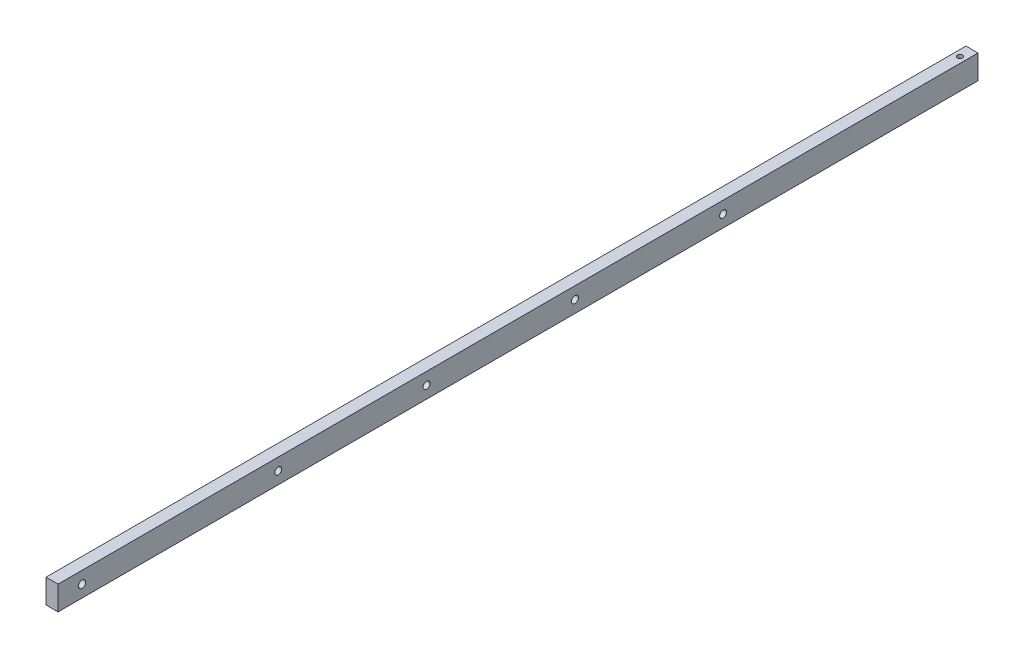
ISO-10303-21;
HEADER;
FILE_DESCRIPTION(('STEP AP214'),'2;1');
FILE_NAME('part.step','',(''),(''),'','','');
FILE_SCHEMA(('AUTOMOTIVE_DESIGN { 1 0 10303 214 1 1 1 1 }'));
ENDSEC;
DATA;
#1=APPLICATION_CONTEXT('core data for automotive mechanical design processes');
#2=APPLICATION_PROTOCOL_DEFINITION('international standard','automotive_design',2000,#1);
#3=PRODUCT_CONTEXT('',#1,'mechanical');
#4=PRODUCT('Part','Part','',(#3));
#5=PRODUCT_RELATED_PRODUCT_CATEGORY('part','',(#4));
#6=PRODUCT_DEFINITION_FORMATION('','',#4);
#7=PRODUCT_DEFINITION_CONTEXT('part definition',#1,'design');
#8=PRODUCT_DEFINITION('design','',#6,#7);
#9=PRODUCT_DEFINITION_SHAPE('','',#8);
#10=(LENGTH_UNIT() NAMED_UNIT(*) SI_UNIT(.MILLI.,.METRE.));
#11=(NAMED_UNIT(*) PLANE_ANGLE_UNIT() SI_UNIT($,.RADIAN.));
#12=(NAMED_UNIT(*) SI_UNIT($,.STERADIAN.) SOLID_ANGLE_UNIT());
#13=UNCERTAINTY_MEASURE_WITH_UNIT(LENGTH_MEASURE(1.E-05),#10,'distance_accuracy_value','');
#14=(GEOMETRIC_REPRESENTATION_CONTEXT(3) GLOBAL_UNCERTAINTY_ASSIGNED_CONTEXT((#13)) GLOBAL_UNIT_ASSIGNED_CONTEXT((#10,
#11,#12)) REPRESENTATION_CONTEXT('',''));
#15=CARTESIAN_POINT('',(0.,0.,0.));
#16=DIRECTION('',(0.,0.,1.));
#17=DIRECTION('',(1.,0.,0.));
#18=AXIS2_PLACEMENT_3D('',#15,#16,#17);
#19=CARTESIAN_POINT('',(0.,0.,485.14));
#20=DIRECTION('',(1.,0.,0.));
#21=DIRECTION('',(0.,0.,-1.));
#22=AXIS2_PLACEMENT_3D('',#19,#20,#21);
#23=PLANE('',#22);
#24=CARTESIAN_POINT('',(-1.10963978658706E-13,6.35000000000008,369.033439454375));
#25=DIRECTION('',(-1.,0.,0.));
#26=DIRECTION('',(0.,0.,1.));
#27=AXIS2_PLACEMENT_3D('',#24,#25,#26);
#28=CIRCLE('',#27,1.8288);
#29=CARTESIAN_POINT('',(-1.10963978658706E-13,6.35000000000008,370.862239454375));
#30=VERTEX_POINT('',#29);
#31=EDGE_CURVE('E155',#30,#30,#28,.T.);
#32=ORIENTED_EDGE('',*,*,#31,.F.);
#33=EDGE_LOOP('',(#32));
#34=FACE_BOUND('',#33,.T.);
#35=CARTESIAN_POINT('',(-1.10963978658706E-13,6.35000000000008,212.569439454375));
#36=DIRECTION('',(-1.,0.,0.));
#37=DIRECTION('',(0.,0.,1.));
#38=AXIS2_PLACEMENT_3D('',#35,#36,#37);
#39=CIRCLE('',#38,1.8288);
#40=CARTESIAN_POINT('',(-1.10963978658706E-13,6.35000000000008,214.398239454375));
#41=VERTEX_POINT('',#40);
#42=EDGE_CURVE('E149',#41,#41,#39,.T.);
#43=ORIENTED_EDGE('',*,*,#42,.F.);
#44=EDGE_LOOP('',(#43));
#45=FACE_BOUND('',#44,.T.);
#46=CARTESIAN_POINT('',(-1.10963978658706E-13,6.35000000000008,290.801439454375));
#47=DIRECTION('',(-1.,0.,0.));
#48=DIRECTION('',(0.,0.,1.));
#49=AXIS2_PLACEMENT_3D('',#46,#47,#48);
#50=CIRCLE('',#49,1.8288);
#51=CARTESIAN_POINT('',(-1.10963978658706E-13,6.35000000000008,292.630239454375));
#52=VERTEX_POINT('',#51);
#53=EDGE_CURVE('E143',#52,#52,#50,.T.);
#54=ORIENTED_EDGE('',*,*,#53,.F.);
#55=EDGE_LOOP('',(#54));
#56=FACE_BOUND('',#55,.T.);
#57=CARTESIAN_POINT('',(-1.10963978658706E-13,6.35000000000008,134.430638313341));
#58=DIRECTION('',(-1.,0.,0.));
#59=DIRECTION('',(0.,0.,1.));
#60=AXIS2_PLACEMENT_3D('',#57,#58,#59);
#61=CIRCLE('',#60,1.8288);
#62=CARTESIAN_POINT('',(-1.10963978658706E-13,6.35000000000008,136.259438313341));
#63=VERTEX_POINT('',#62);
#64=EDGE_CURVE('E137',#63,#63,#61,.T.);
#65=ORIENTED_EDGE('',*,*,#64,.F.);
#66=EDGE_LOOP('',(#65));
#67=FACE_BOUND('',#66,.T.);
#68=CARTESIAN_POINT('',(0.,6.35,472.44));
#69=DIRECTION('',(1.,0.,0.));
#70=DIRECTION('',(0.,0.,-1.));
#71=AXIS2_PLACEMENT_3D('',#68,#69,#70);
#72=CIRCLE('',#71,1.89865);
#73=CARTESIAN_POINT('',(0.,6.35,470.54135));
#74=VERTEX_POINT('',#73);
#75=EDGE_CURVE('E112',#74,#74,#72,.T.);
#76=ORIENTED_EDGE('',*,*,#75,.T.);
#77=EDGE_LOOP('',(#76));
#78=FACE_BOUND('',#77,.T.);
#79=DIRECTION('',(0.,-1.,0.));
#80=VECTOR('',#79,1.);
#81=CARTESIAN_POINT('',(0.,0.,0.));
#82=LINE('',#81,#80);
#83=CARTESIAN_POINT('',(0.,12.7,0.));
#84=VERTEX_POINT('',#83);
#85=CARTESIAN_POINT('',(0.,0.,0.));
#86=VERTEX_POINT('',#85);
#87=EDGE_CURVE('E109',#84,#86,#82,.T.);
#88=ORIENTED_EDGE('',*,*,#87,.T.);
#89=DIRECTION('',(0.,0.,-1.));
#90=VECTOR('',#89,1.);
#91=CARTESIAN_POINT('',(0.,0.,485.14));
#92=LINE('',#91,#90);
#93=CARTESIAN_POINT('',(0.,0.,485.14));
#94=VERTEX_POINT('',#93);
#95=EDGE_CURVE('E13',#94,#86,#92,.T.);
#96=ORIENTED_EDGE('',*,*,#95,.F.);
#97=DIRECTION('',(0.,-1.,0.));
#98=VECTOR('',#97,1.);
#99=CARTESIAN_POINT('',(0.,0.,485.14));
#100=LINE('',#99,#98);
#101=CARTESIAN_POINT('',(0.,12.7,485.14));
#102=VERTEX_POINT('',#101);
#103=EDGE_CURVE('E97',#102,#94,#100,.T.);
#104=ORIENTED_EDGE('',*,*,#103,.F.);
#105=DIRECTION('',(0.,0.,-1.));
#106=VECTOR('',#105,1.);
#107=CARTESIAN_POINT('',(0.,12.7,485.14));
#108=LINE('',#107,#106);
#109=EDGE_CURVE('E105',#102,#84,#108,.T.);
#110=ORIENTED_EDGE('',*,*,#109,.T.);
#111=EDGE_LOOP('',(#88,#96,#104,#110));
#112=FACE_BOUND('',#111,.T.);
#113=ADVANCED_FACE('F46',(#34,#45,#56,#67,#78,#112),#23,.F.);
#114=CARTESIAN_POINT('',(0.,0.,485.14));
#115=DIRECTION('',(0.,1.,0.));
#116=DIRECTION('',(0.,0.,1.));
#117=AXIS2_PLACEMENT_3D('',#114,#115,#116);
#118=PLANE('',#117);
#119=CARTESIAN_POINT('',(3.175,0.,6.35));
#120=DIRECTION('',(0.,1.,0.));
#121=DIRECTION('',(0.,0.,1.));
#122=AXIS2_PLACEMENT_3D('',#119,#120,#121);
#123=CIRCLE('',#122,1.35254999999999);
#124=CARTESIAN_POINT('',(3.175,0.,7.70254999999999));
#125=VERTEX_POINT('',#124);
#126=EDGE_CURVE('E128',#125,#125,#123,.T.);
#127=ORIENTED_EDGE('',*,*,#126,.T.);
#128=EDGE_LOOP('',(#127));
#129=FACE_BOUND('',#128,.T.);
#130=DIRECTION('',(1.,0.,0.));
#131=VECTOR('',#130,1.);
#132=CARTESIAN_POINT('',(0.,0.,0.));
#133=LINE('',#132,#131);
#134=CARTESIAN_POINT('',(6.35,0.,0.));
#135=VERTEX_POINT('',#134);
#136=EDGE_CURVE('E101',#86,#135,#133,.T.);
#137=ORIENTED_EDGE('',*,*,#136,.T.);
#138=DIRECTION('',(0.,0.,-1.));
#139=VECTOR('',#138,1.);
#140=CARTESIAN_POINT('',(6.35,0.,485.14));
#141=LINE('',#140,#139);
#142=CARTESIAN_POINT('',(6.35,0.,485.14));
#143=VERTEX_POINT('',#142);
#144=EDGE_CURVE('E54',#143,#135,#141,.T.);
#145=ORIENTED_EDGE('',*,*,#144,.F.);
#146=DIRECTION('',(1.,0.,0.));
#147=VECTOR('',#146,1.);
#148=CARTESIAN_POINT('',(0.,0.,485.14));
#149=LINE('',#148,#147);
#150=EDGE_CURVE('E92',#94,#143,#149,.T.);
#151=ORIENTED_EDGE('',*,*,#150,.F.);
#152=ORIENTED_EDGE('',*,*,#95,.T.);
#153=EDGE_LOOP('',(#137,#145,#151,#152));
#154=FACE_BOUND('',#153,.T.);
#155=ADVANCED_FACE('F100',(#129,#154),#118,.F.);
#156=CARTESIAN_POINT('',(6.35,0.,485.14));
#157=DIRECTION('',(-1.,0.,0.));
#158=DIRECTION('',(0.,0.,1.));
#159=AXIS2_PLACEMENT_3D('',#156,#157,#158);
#160=PLANE('',#159);
#161=CARTESIAN_POINT('',(6.35,6.35000000000008,369.033439454375));
#162=DIRECTION('',(-1.,0.,0.));
#163=DIRECTION('',(0.,0.,1.));
#164=AXIS2_PLACEMENT_3D('',#161,#162,#163);
#165=CIRCLE('',#164,1.8288);
#166=CARTESIAN_POINT('',(6.35,6.35000000000008,370.862239454375));
#167=VERTEX_POINT('',#166);
#168=EDGE_CURVE('E152',#167,#167,#165,.T.);
#169=ORIENTED_EDGE('',*,*,#168,.T.);
#170=EDGE_LOOP('',(#169));
#171=FACE_BOUND('',#170,.T.);
#172=CARTESIAN_POINT('',(6.35,6.35000000000008,212.569439454375));
#173=DIRECTION('',(-1.,0.,0.));
#174=DIRECTION('',(0.,0.,1.));
#175=AXIS2_PLACEMENT_3D('',#172,#173,#174);
#176=CIRCLE('',#175,1.8288);
#177=CARTESIAN_POINT('',(6.35,6.35000000000008,214.398239454375));
#178=VERTEX_POINT('',#177);
#179=EDGE_CURVE('E146',#178,#178,#176,.T.);
#180=ORIENTED_EDGE('',*,*,#179,.T.);
#181=EDGE_LOOP('',(#180));
#182=FACE_BOUND('',#181,.T.);
#183=CARTESIAN_POINT('',(6.35,6.35000000000008,290.801439454375));
#184=DIRECTION('',(-1.,0.,0.));
#185=DIRECTION('',(0.,0.,1.));
#186=AXIS2_PLACEMENT_3D('',#183,#184,#185);
#187=CIRCLE('',#186,1.8288);
#188=CARTESIAN_POINT('',(6.35,6.35000000000008,292.630239454375));
#189=VERTEX_POINT('',#188);
#190=EDGE_CURVE('E140',#189,#189,#187,.T.);
#191=ORIENTED_EDGE('',*,*,#190,.T.);
#192=EDGE_LOOP('',(#191));
#193=FACE_BOUND('',#192,.T.);
#194=CARTESIAN_POINT('',(6.35,6.35000000000008,134.430638313341));
#195=DIRECTION('',(-1.,0.,0.));
#196=DIRECTION('',(0.,0.,1.));
#197=AXIS2_PLACEMENT_3D('',#194,#195,#196);
#198=CIRCLE('',#197,1.8288);
#199=CARTESIAN_POINT('',(6.35,6.35000000000008,136.259438313341));
#200=VERTEX_POINT('',#199);
#201=EDGE_CURVE('E134',#200,#200,#198,.T.);
#202=ORIENTED_EDGE('',*,*,#201,.T.);
#203=EDGE_LOOP('',(#202));
#204=FACE_BOUND('',#203,.T.);
#205=CARTESIAN_POINT('',(6.35,6.35,472.44));
#206=DIRECTION('',(1.,0.,0.));
#207=DIRECTION('',(0.,0.,-1.));
#208=AXIS2_PLACEMENT_3D('',#205,#206,#207);
#209=CIRCLE('',#208,1.89865);
#210=CARTESIAN_POINT('',(6.35,6.35,470.54135));
#211=VERTEX_POINT('',#210);
#212=EDGE_CURVE('E125',#211,#211,#209,.T.);
#213=ORIENTED_EDGE('',*,*,#212,.F.);
#214=EDGE_LOOP('',(#213));
#215=FACE_BOUND('',#214,.T.);
#216=DIRECTION('',(0.,1.,0.));
#217=VECTOR('',#216,1.);
#218=CARTESIAN_POINT('',(6.35,0.,0.));
#219=LINE('',#218,#217);
#220=CARTESIAN_POINT('',(6.35,12.7,0.));
#221=VERTEX_POINT('',#220);
#222=EDGE_CURVE('E79',#135,#221,#219,.T.);
#223=ORIENTED_EDGE('',*,*,#222,.T.);
#224=DIRECTION('',(0.,0.,-1.));
#225=VECTOR('',#224,1.);
#226=CARTESIAN_POINT('',(6.35,12.7,485.14));
#227=LINE('',#226,#225);
#228=CARTESIAN_POINT('',(6.35,12.7,485.14));
#229=VERTEX_POINT('',#228);
#230=EDGE_CURVE('E102',#229,#221,#227,.T.);
#231=ORIENTED_EDGE('',*,*,#230,.F.);
#232=DIRECTION('',(0.,1.,0.));
#233=VECTOR('',#232,1.);
#234=CARTESIAN_POINT('',(6.35,0.,485.14));
#235=LINE('',#234,#233);
#236=EDGE_CURVE('E95',#143,#229,#235,.T.);
#237=ORIENTED_EDGE('',*,*,#236,.F.);
#238=ORIENTED_EDGE('',*,*,#144,.T.);
#239=EDGE_LOOP('',(#223,#231,#237,#238));
#240=FACE_BOUND('',#239,.T.);
#241=ADVANCED_FACE('F103',(#171,#182,#193,#204,#215,#240),#160,.F.);
#242=CARTESIAN_POINT('',(0.,12.7,485.14));
#243=DIRECTION('',(0.,-1.,0.));
#244=DIRECTION('',(0.,0.,-1.));
#245=AXIS2_PLACEMENT_3D('',#242,#243,#244);
#246=PLANE('',#245);
#247=CARTESIAN_POINT('',(3.175,12.7,6.35));
#248=DIRECTION('',(0.,1.,0.));
#249=DIRECTION('',(0.,0.,1.));
#250=AXIS2_PLACEMENT_3D('',#247,#248,#249);
#251=CIRCLE('',#250,1.35255);
#252=CARTESIAN_POINT('',(3.175,12.7,7.70255));
#253=VERTEX_POINT('',#252);
#254=EDGE_CURVE('E131',#253,#253,#251,.T.);
#255=ORIENTED_EDGE('',*,*,#254,.F.);
#256=EDGE_LOOP('',(#255));
#257=FACE_BOUND('',#256,.T.);
#258=DIRECTION('',(-1.,0.,0.));
#259=VECTOR('',#258,1.);
#260=CARTESIAN_POINT('',(0.,12.7,0.));
#261=LINE('',#260,#259);
#262=EDGE_CURVE('E85',#221,#84,#261,.T.);
#263=ORIENTED_EDGE('',*,*,#262,.T.);
#264=ORIENTED_EDGE('',*,*,#109,.F.);
#265=DIRECTION('',(-1.,0.,0.));
#266=VECTOR('',#265,1.);
#267=CARTESIAN_POINT('',(0.,12.7,485.14));
#268=LINE('',#267,#266);
#269=EDGE_CURVE('E62',#229,#102,#268,.T.);
#270=ORIENTED_EDGE('',*,*,#269,.F.);
#271=ORIENTED_EDGE('',*,*,#230,.T.);
#272=EDGE_LOOP('',(#263,#264,#270,#271));
#273=FACE_BOUND('',#272,.T.);
#274=ADVANCED_FACE('F117',(#257,#273),#246,.F.);
#275=CARTESIAN_POINT('',(0.,0.,485.14));
#276=DIRECTION('',(0.,0.,-1.));
#277=DIRECTION('',(-1.,0.,0.));
#278=AXIS2_PLACEMENT_3D('',#275,#276,#277);
#279=PLANE('',#278);
#280=ORIENTED_EDGE('',*,*,#103,.T.);
#281=ORIENTED_EDGE('',*,*,#150,.T.);
#282=ORIENTED_EDGE('',*,*,#236,.T.);
#283=ORIENTED_EDGE('',*,*,#269,.T.);
#284=EDGE_LOOP('',(#280,#281,#282,#283));
#285=FACE_BOUND('',#284,.T.);
#286=ADVANCED_FACE('F93',(#285),#279,.F.);
#287=CARTESIAN_POINT('',(0.,0.,0.));
#288=DIRECTION('',(0.,0.,-1.));
#289=DIRECTION('',(-1.,0.,0.));
#290=AXIS2_PLACEMENT_3D('',#287,#288,#289);
#291=PLANE('',#290);
#292=ORIENTED_EDGE('',*,*,#87,.F.);
#293=ORIENTED_EDGE('',*,*,#262,.F.);
#294=ORIENTED_EDGE('',*,*,#222,.F.);
#295=ORIENTED_EDGE('',*,*,#136,.F.);
#296=EDGE_LOOP('',(#292,#293,#294,#295));
#297=FACE_BOUND('',#296,.T.);
#298=ADVANCED_FACE('F120',(#297),#291,.T.);
#299=CARTESIAN_POINT('',(6.35,6.35,472.44));
#300=DIRECTION('',(1.,0.,0.));
#301=DIRECTION('',(0.,0.,-1.));
#302=AXIS2_PLACEMENT_3D('',#299,#300,#301);
#303=CYLINDRICAL_SURFACE('',#302,1.89865);
#304=ORIENTED_EDGE('',*,*,#75,.F.);
#305=EDGE_LOOP('',(#304));
#306=FACE_BOUND('',#305,.T.);
#307=ORIENTED_EDGE('',*,*,#212,.T.);
#308=EDGE_LOOP('',(#307));
#309=FACE_BOUND('',#308,.T.);
#310=ADVANCED_FACE('F171',(#306,#309),#303,.F.);
#311=CARTESIAN_POINT('',(3.175,12.7,6.35));
#312=DIRECTION('',(0.,1.,0.));
#313=DIRECTION('',(0.,0.,1.));
#314=AXIS2_PLACEMENT_3D('',#311,#312,#313);
#315=CYLINDRICAL_SURFACE('',#314,1.35255);
#316=ORIENTED_EDGE('',*,*,#126,.F.);
#317=EDGE_LOOP('',(#316));
#318=FACE_BOUND('',#317,.T.);
#319=ORIENTED_EDGE('',*,*,#254,.T.);
#320=EDGE_LOOP('',(#319));
#321=FACE_BOUND('',#320,.T.);
#322=ADVANCED_FACE('F174',(#318,#321),#315,.F.);
#323=CARTESIAN_POINT('',(-1.11022302462516E-13,6.35000000000008,134.430638313341));
#324=DIRECTION('',(-1.,0.,0.));
#325=DIRECTION('',(0.,0.,1.));
#326=AXIS2_PLACEMENT_3D('',#323,#324,#325);
#327=CYLINDRICAL_SURFACE('',#326,1.8288);
#328=ORIENTED_EDGE('',*,*,#201,.F.);
#329=EDGE_LOOP('',(#328));
#330=FACE_BOUND('',#329,.T.);
#331=ORIENTED_EDGE('',*,*,#64,.T.);
#332=EDGE_LOOP('',(#331));
#333=FACE_BOUND('',#332,.T.);
#334=ADVANCED_FACE('F196',(#330,#333),#327,.F.);
#335=CARTESIAN_POINT('',(-1.11022302462516E-13,6.35000000000008,290.801439454375));
#336=DIRECTION('',(-1.,0.,0.));
#337=DIRECTION('',(0.,0.,1.));
#338=AXIS2_PLACEMENT_3D('',#335,#336,#337);
#339=CYLINDRICAL_SURFACE('',#338,1.8288);
#340=ORIENTED_EDGE('',*,*,#190,.F.);
#341=EDGE_LOOP('',(#340));
#342=FACE_BOUND('',#341,.T.);
#343=ORIENTED_EDGE('',*,*,#53,.T.);
#344=EDGE_LOOP('',(#343));
#345=FACE_BOUND('',#344,.T.);
#346=ADVANCED_FACE('F200',(#342,#345),#339,.F.);
#347=CARTESIAN_POINT('',(-1.11022302462516E-13,6.35000000000008,212.569439454375));
#348=DIRECTION('',(-1.,0.,0.));
#349=DIRECTION('',(0.,0.,1.));
#350=AXIS2_PLACEMENT_3D('',#347,#348,#349);
#351=CYLINDRICAL_SURFACE('',#350,1.8288);
#352=ORIENTED_EDGE('',*,*,#179,.F.);
#353=EDGE_LOOP('',(#352));
#354=FACE_BOUND('',#353,.T.);
#355=ORIENTED_EDGE('',*,*,#42,.T.);
#356=EDGE_LOOP('',(#355));
#357=FACE_BOUND('',#356,.T.);
#358=ADVANCED_FACE('F204',(#354,#357),#351,.F.);
#359=CARTESIAN_POINT('',(-1.11022302462516E-13,6.35000000000008,369.033439454375));
#360=DIRECTION('',(-1.,0.,0.));
#361=DIRECTION('',(0.,0.,1.));
#362=AXIS2_PLACEMENT_3D('',#359,#360,#361);
#363=CYLINDRICAL_SURFACE('',#362,1.8288);
#364=ORIENTED_EDGE('',*,*,#168,.F.);
#365=EDGE_LOOP('',(#364));
#366=FACE_BOUND('',#365,.T.);
#367=ORIENTED_EDGE('',*,*,#31,.T.);
#368=EDGE_LOOP('',(#367));
#369=FACE_BOUND('',#368,.T.);
#370=ADVANCED_FACE('F159',(#366,#369),#363,.F.);
#371=CLOSED_SHELL('',(#113,#155,#241,#274,#286,#298,#310,#322,#334,#346,#358,#370));
#372=MANIFOLD_SOLID_BREP('B2',#371);
#373=ADVANCED_BREP_SHAPE_REPRESENTATION('',(#18,#372),#14);
#374=SHAPE_DEFINITION_REPRESENTATION(#9,#373);
ENDSEC;
END-ISO-10303-21;
